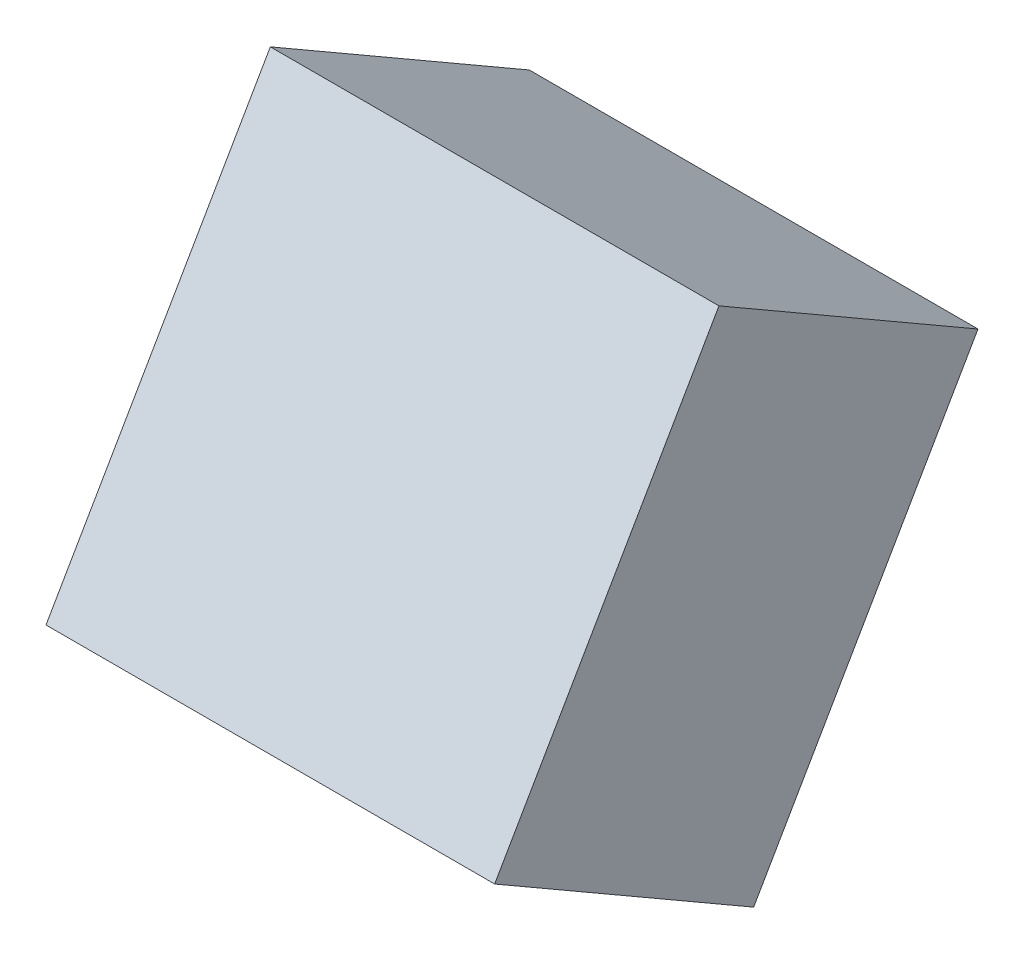
ISO-10303-21;
HEADER;
FILE_DESCRIPTION(('STEP AP214'),'2;1');
FILE_NAME('part.step','',(''),(''),'','','');
FILE_SCHEMA(('AUTOMOTIVE_DESIGN { 1 0 10303 214 1 1 1 1 }'));
ENDSEC;
DATA;
#1=APPLICATION_CONTEXT('core data for automotive mechanical design processes');
#2=APPLICATION_PROTOCOL_DEFINITION('international standard','automotive_design',2000,#1);
#3=PRODUCT_CONTEXT('',#1,'mechanical');
#4=PRODUCT('Part','Part','',(#3));
#5=PRODUCT_RELATED_PRODUCT_CATEGORY('part','',(#4));
#6=PRODUCT_DEFINITION_FORMATION('','',#4);
#7=PRODUCT_DEFINITION_CONTEXT('part definition',#1,'design');
#8=PRODUCT_DEFINITION('design','',#6,#7);
#9=PRODUCT_DEFINITION_SHAPE('','',#8);
#10=(LENGTH_UNIT() NAMED_UNIT(*) SI_UNIT(.MILLI.,.METRE.));
#11=(NAMED_UNIT(*) PLANE_ANGLE_UNIT() SI_UNIT($,.RADIAN.));
#12=(NAMED_UNIT(*) SI_UNIT($,.STERADIAN.) SOLID_ANGLE_UNIT());
#13=UNCERTAINTY_MEASURE_WITH_UNIT(LENGTH_MEASURE(1.E-05),#10,'distance_accuracy_value','');
#14=(GEOMETRIC_REPRESENTATION_CONTEXT(3) GLOBAL_UNCERTAINTY_ASSIGNED_CONTEXT((#13)) GLOBAL_UNIT_ASSIGNED_CONTEXT((#10,
#11,#12)) REPRESENTATION_CONTEXT('',''));
#15=CARTESIAN_POINT('',(0.,0.,0.));
#16=DIRECTION('',(0.,0.,1.));
#17=DIRECTION('',(1.,0.,0.));
#18=AXIS2_PLACEMENT_3D('',#15,#16,#17);
#19=CARTESIAN_POINT('',(93.,20.5934393919997,23.334292143521));
#20=DIRECTION('',(0.,0.5,0.866025403784439));
#21=DIRECTION('',(0.,-0.866025403784439,0.5));
#22=AXIS2_PLACEMENT_3D('',#19,#20,#21);
#23=PLANE('',#22);
#24=DIRECTION('',(1.,0.,0.));
#25=VECTOR('',#24,1.);
#26=CARTESIAN_POINT('',(96.,23.191515603353,21.834292143521));
#27=LINE('',#26,#25);
#28=CARTESIAN_POINT('',(90.,23.191515603353,21.834292143521));
#29=VERTEX_POINT('',#28);
#30=CARTESIAN_POINT('',(96.,23.191515603353,21.834292143521));
#31=VERTEX_POINT('',#30);
#32=EDGE_CURVE('E53',#29,#31,#27,.T.);
#33=ORIENTED_EDGE('',*,*,#32,.F.);
#34=DIRECTION('',(0.,0.866025403784437,-0.500000000000002));
#35=VECTOR('',#34,1.);
#36=CARTESIAN_POINT('',(90.,17.9953631806464,24.834292143521));
#37=LINE('',#36,#35);
#38=CARTESIAN_POINT('',(90.,17.9953631806464,24.834292143521));
#39=VERTEX_POINT('',#38);
#40=EDGE_CURVE('E68',#39,#29,#37,.T.);
#41=ORIENTED_EDGE('',*,*,#40,.F.);
#42=DIRECTION('',(1.,0.,0.));
#43=VECTOR('',#42,1.);
#44=CARTESIAN_POINT('',(90.,17.9953631806464,24.834292143521));
#45=LINE('',#44,#43);
#46=CARTESIAN_POINT('',(96.,17.9953631806464,24.834292143521));
#47=VERTEX_POINT('',#46);
#48=EDGE_CURVE('E20',#47,#39,#45,.F.);
#49=ORIENTED_EDGE('',*,*,#48,.F.);
#50=DIRECTION('',(0.,-0.866025403784437,0.500000000000002));
#51=VECTOR('',#50,1.);
#52=CARTESIAN_POINT('',(96.,23.191515603353,21.834292143521));
#53=LINE('',#52,#51);
#54=EDGE_CURVE('E58',#31,#47,#53,.T.);
#55=ORIENTED_EDGE('',*,*,#54,.F.);
#56=EDGE_LOOP('',(#33,#41,#49,#55));
#57=FACE_BOUND('',#56,.T.);
#58=ADVANCED_FACE('F17',(#57),#23,.T.);
#59=CARTESIAN_POINT('',(90.,15.9953631806464,21.3701905283833));
#60=DIRECTION('',(0.,-0.866025403784439,0.5));
#61=DIRECTION('',(0.,-0.5,-0.866025403784439));
#62=AXIS2_PLACEMENT_3D('',#59,#60,#61);
#63=PLANE('',#62);
#64=ORIENTED_EDGE('',*,*,#48,.T.);
#65=DIRECTION('',(0.,0.500000000000006,0.866025403784435));
#66=VECTOR('',#65,1.);
#67=CARTESIAN_POINT('',(90.,15.9953631806464,21.3701905283833));
#68=LINE('',#67,#66);
#69=CARTESIAN_POINT('',(90.,15.9953631806464,21.3701905283833));
#70=VERTEX_POINT('',#69);
#71=EDGE_CURVE('E79',#70,#39,#68,.T.);
#72=ORIENTED_EDGE('',*,*,#71,.F.);
#73=DIRECTION('',(1.,0.,0.));
#74=VECTOR('',#73,1.);
#75=CARTESIAN_POINT('',(52.8749999999999,15.9953631806464,21.3701905283833));
#76=LINE('',#75,#74);
#77=CARTESIAN_POINT('',(96.,15.9953631806464,21.3701905283833));
#78=VERTEX_POINT('',#77);
#79=EDGE_CURVE('E74',#70,#78,#76,.T.);
#80=ORIENTED_EDGE('',*,*,#79,.T.);
#81=DIRECTION('',(0.,-0.500000000000006,-0.866025403784435));
#82=VECTOR('',#81,1.);
#83=CARTESIAN_POINT('',(96.,17.9953631806464,24.834292143521));
#84=LINE('',#83,#82);
#85=EDGE_CURVE('E63',#47,#78,#84,.T.);
#86=ORIENTED_EDGE('',*,*,#85,.F.);
#87=EDGE_LOOP('',(#64,#72,#80,#86));
#88=FACE_BOUND('',#87,.T.);
#89=ADVANCED_FACE('F73',(#88),#63,.T.);
#90=CARTESIAN_POINT('',(96.,15.9953631806464,21.3701905283833));
#91=DIRECTION('',(1.,0.,0.));
#92=DIRECTION('',(0.,0.,-1.));
#93=AXIS2_PLACEMENT_3D('',#90,#91,#92);
#94=PLANE('',#93);
#95=ORIENTED_EDGE('',*,*,#54,.T.);
#96=ORIENTED_EDGE('',*,*,#85,.T.);
#97=DIRECTION('',(0.,-0.866025403784439,0.5));
#98=VECTOR('',#97,1.);
#99=CARTESIAN_POINT('',(96.,29.8442066707183,13.3745570114253));
#100=LINE('',#99,#98);
#101=CARTESIAN_POINT('',(96.,21.191515603353,18.3701905283833));
#102=VERTEX_POINT('',#101);
#103=EDGE_CURVE('E84',#78,#102,#100,.F.);
#104=ORIENTED_EDGE('',*,*,#103,.T.);
#105=DIRECTION('',(0.,0.5,0.866025403784439));
#106=VECTOR('',#105,1.);
#107=CARTESIAN_POINT('',(96.,21.191515603353,18.3701905283833));
#108=LINE('',#107,#106);
#109=EDGE_CURVE('E65',#31,#102,#108,.F.);
#110=ORIENTED_EDGE('',*,*,#109,.F.);
#111=EDGE_LOOP('',(#95,#96,#104,#110));
#112=FACE_BOUND('',#111,.T.);
#113=ADVANCED_FACE('F60',(#112),#94,.T.);
#114=CARTESIAN_POINT('',(96.,21.191515603353,18.3701905283833));
#115=DIRECTION('',(0.,0.866025403784439,-0.5));
#116=DIRECTION('',(0.,0.5,0.866025403784439));
#117=AXIS2_PLACEMENT_3D('',#114,#115,#116);
#118=PLANE('',#117);
#119=ORIENTED_EDGE('',*,*,#32,.T.);
#120=ORIENTED_EDGE('',*,*,#109,.T.);
#121=DIRECTION('',(1.,0.,0.));
#122=VECTOR('',#121,1.);
#123=CARTESIAN_POINT('',(52.8749999999999,21.191515603353,18.3701905283833));
#124=LINE('',#123,#122);
#125=CARTESIAN_POINT('',(90.,21.191515603353,18.3701905283833));
#126=VERTEX_POINT('',#125);
#127=EDGE_CURVE('E26',#102,#126,#124,.F.);
#128=ORIENTED_EDGE('',*,*,#127,.T.);
#129=DIRECTION('',(0.,-0.500000000000006,-0.866025403784435));
#130=VECTOR('',#129,1.);
#131=CARTESIAN_POINT('',(90.,23.191515603353,21.834292143521));
#132=LINE('',#131,#130);
#133=EDGE_CURVE('E34',#29,#126,#132,.T.);
#134=ORIENTED_EDGE('',*,*,#133,.F.);
#135=EDGE_LOOP('',(#119,#120,#128,#134));
#136=FACE_BOUND('',#135,.T.);
#137=ADVANCED_FACE('F88',(#136),#118,.T.);
#138=CARTESIAN_POINT('',(90.,21.191515603353,18.3701905283833));
#139=DIRECTION('',(-1.,0.,0.));
#140=DIRECTION('',(0.,0.,1.));
#141=AXIS2_PLACEMENT_3D('',#138,#139,#140);
#142=PLANE('',#141);
#143=ORIENTED_EDGE('',*,*,#40,.T.);
#144=ORIENTED_EDGE('',*,*,#133,.T.);
#145=DIRECTION('',(0.,-0.866025403784439,0.5));
#146=VECTOR('',#145,1.);
#147=CARTESIAN_POINT('',(90.,29.8442066707183,13.3745570114253));
#148=LINE('',#147,#146);
#149=EDGE_CURVE('E11',#126,#70,#148,.T.);
#150=ORIENTED_EDGE('',*,*,#149,.T.);
#151=ORIENTED_EDGE('',*,*,#71,.T.);
#152=EDGE_LOOP('',(#143,#144,#150,#151));
#153=FACE_BOUND('',#152,.T.);
#154=ADVANCED_FACE('F91',(#153),#142,.T.);
#155=CARTESIAN_POINT('',(52.8749999999999,29.8442066707183,13.3745570114253));
#156=DIRECTION('',(0.,0.5,0.866025403784439));
#157=DIRECTION('',(0.,-0.866025403784439,0.5));
#158=AXIS2_PLACEMENT_3D('',#155,#156,#157);
#159=PLANE('',#158);
#160=ORIENTED_EDGE('',*,*,#127,.F.);
#161=ORIENTED_EDGE('',*,*,#103,.F.);
#162=ORIENTED_EDGE('',*,*,#79,.F.);
#163=ORIENTED_EDGE('',*,*,#149,.F.);
#164=EDGE_LOOP('',(#160,#161,#162,#163));
#165=FACE_BOUND('',#164,.T.);
#166=ADVANCED_FACE('F90',(#165),#159,.F.);
#167=CLOSED_SHELL('',(#58,#89,#113,#137,#154,#166));
#168=MANIFOLD_SOLID_BREP('B1',#167);
#169=ADVANCED_BREP_SHAPE_REPRESENTATION('',(#18,#168),#14);
#170=SHAPE_DEFINITION_REPRESENTATION(#9,#169);
ENDSEC;
END-ISO-10303-21;
